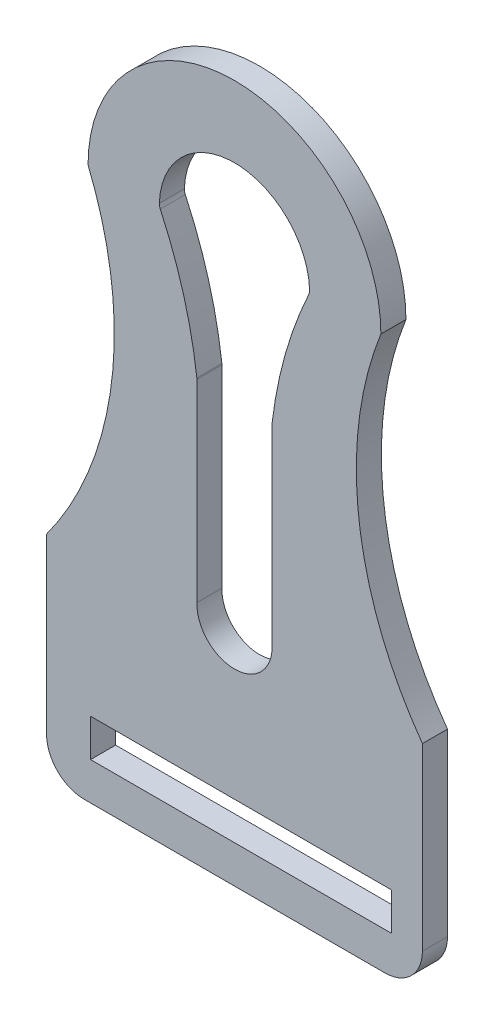
ISO-10303-21;
HEADER;
FILE_DESCRIPTION(('STEP AP214'),'2;1');
FILE_NAME('part.step','',(''),(''),'','','');
FILE_SCHEMA(('AUTOMOTIVE_DESIGN { 1 0 10303 214 1 1 1 1 }'));
ENDSEC;
DATA;
#1=APPLICATION_CONTEXT('core data for automotive mechanical design processes');
#2=APPLICATION_PROTOCOL_DEFINITION('international standard','automotive_design',2000,#1);
#3=PRODUCT_CONTEXT('',#1,'mechanical');
#4=PRODUCT('Part','Part','',(#3));
#5=PRODUCT_RELATED_PRODUCT_CATEGORY('part','',(#4));
#6=PRODUCT_DEFINITION_FORMATION('','',#4);
#7=PRODUCT_DEFINITION_CONTEXT('part definition',#1,'design');
#8=PRODUCT_DEFINITION('design','',#6,#7);
#9=PRODUCT_DEFINITION_SHAPE('','',#8);
#10=(LENGTH_UNIT() NAMED_UNIT(*) SI_UNIT(.MILLI.,.METRE.));
#11=(NAMED_UNIT(*) PLANE_ANGLE_UNIT() SI_UNIT($,.RADIAN.));
#12=(NAMED_UNIT(*) SI_UNIT($,.STERADIAN.) SOLID_ANGLE_UNIT());
#13=UNCERTAINTY_MEASURE_WITH_UNIT(LENGTH_MEASURE(1.E-05),#10,'distance_accuracy_value','');
#14=(GEOMETRIC_REPRESENTATION_CONTEXT(3) GLOBAL_UNCERTAINTY_ASSIGNED_CONTEXT((#13)) GLOBAL_UNIT_ASSIGNED_CONTEXT((#10,
#11,#12)) REPRESENTATION_CONTEXT('',''));
#15=CARTESIAN_POINT('',(0.,0.,0.));
#16=DIRECTION('',(0.,0.,1.));
#17=DIRECTION('',(1.,0.,0.));
#18=AXIS2_PLACEMENT_3D('',#15,#16,#17);
#19=CARTESIAN_POINT('',(-38.1,-105.430018939394,6.35));
#20=DIRECTION('',(0.,0.,1.));
#21=DIRECTION('',(1.,0.,0.));
#22=AXIS2_PLACEMENT_3D('',#19,#20,#21);
#23=PLANE('',#22);
#24=CARTESIAN_POINT('',(-116.692382649276,-21.2894366132639,6.35));
#25=DIRECTION('',(0.,0.,-1.));
#26=DIRECTION('',(1.,0.,0.));
#27=AXIS2_PLACEMENT_3D('',#24,#25,#26);
#28=CIRCLE('',#27,107.95);
#29=CARTESIAN_POINT('',(-18.8042247786519,24.2200244766647,6.35));
#30=VERTEX_POINT('',#29);
#31=CARTESIAN_POINT('',(-9.53884624865419,-8.20042836815369,6.35));
#32=VERTEX_POINT('',#31);
#33=EDGE_CURVE('E242',#30,#32,#28,.T.);
#34=ORIENTED_EDGE('',*,*,#33,.F.);
#35=CARTESIAN_POINT('',(-16.5009740052255,25.2908353258395,6.35));
#36=DIRECTION('',(0.,0.,1.));
#37=DIRECTION('',(1.,0.,0.));
#38=AXIS2_PLACEMENT_3D('',#35,#36,#37);
#39=CIRCLE('',#38,2.54);
#40=CARTESIAN_POINT('',(-19.0395853906448,25.3748129051062,6.35));
#41=VERTEX_POINT('',#40);
#42=EDGE_CURVE('E240',#41,#30,#39,.T.);
#43=ORIENTED_EDGE('',*,*,#42,.F.);
#44=CARTESIAN_POINT('',(0.,24.7449810606061,6.35));
#45=DIRECTION('',(0.,0.,1.));
#46=DIRECTION('',(1.,0.,0.));
#47=AXIS2_PLACEMENT_3D('',#44,#45,#46);
#48=CIRCLE('',#47,19.05);
#49=CARTESIAN_POINT('',(19.039643908874,25.3730414265562,6.35));
#50=VERTEX_POINT('',#49);
#51=EDGE_CURVE('E259',#50,#41,#48,.T.);
#52=ORIENTED_EDGE('',*,*,#51,.F.);
#53=CARTESIAN_POINT('',(16.5010247210241,25.2893000444296,6.35));
#54=DIRECTION('',(0.,0.,1.));
#55=DIRECTION('',(-1.,0.,0.));
#56=AXIS2_PLACEMENT_3D('',#53,#54,#55);
#57=CIRCLE('',#56,2.54);
#58=CARTESIAN_POINT('',(18.8055386735332,24.2212104214619,6.35));
#59=VERTEX_POINT('',#58);
#60=EDGE_CURVE('E256',#59,#50,#57,.T.);
#61=ORIENTED_EDGE('',*,*,#60,.F.);
#62=CARTESIAN_POINT('',(116.747381655168,-21.1725985546614,6.35));
#63=DIRECTION('',(0.,0.,-1.));
#64=DIRECTION('',(1.,0.,0.));
#65=AXIS2_PLACEMENT_3D('',#62,#63,#64);
#66=CIRCLE('',#65,107.95);
#67=CARTESIAN_POINT('',(9.54253297216465,-8.51072985946741,6.35));
#68=VERTEX_POINT('',#67);
#69=EDGE_CURVE('E254',#68,#59,#66,.T.);
#70=ORIENTED_EDGE('',*,*,#69,.F.);
#71=CARTESIAN_POINT('',(12.065,-8.80865618170727,6.35));
#72=DIRECTION('',(0.,0.,-1.));
#73=DIRECTION('',(1.,0.,0.));
#74=AXIS2_PLACEMENT_3D('',#71,#72,#73);
#75=CIRCLE('',#74,2.54);
#76=CARTESIAN_POINT('',(9.52500000000002,-8.80865618170727,6.35));
#77=VERTEX_POINT('',#76);
#78=EDGE_CURVE('E252',#77,#68,#75,.T.);
#79=ORIENTED_EDGE('',*,*,#78,.F.);
#80=DIRECTION('',(0.,1.,0.));
#81=VECTOR('',#80,1.);
#82=CARTESIAN_POINT('',(9.52500000000002,-8.80865618170727,6.35));
#83=LINE('',#82,#81);
#84=CARTESIAN_POINT('',(9.52500000000002,-57.8050189393939,6.35));
#85=VERTEX_POINT('',#84);
#86=EDGE_CURVE('E250',#85,#77,#83,.T.);
#87=ORIENTED_EDGE('',*,*,#86,.F.);
#88=CARTESIAN_POINT('',(0.,-57.8050189393939,6.35));
#89=DIRECTION('',(0.,0.,1.));
#90=DIRECTION('',(-1.,0.,0.));
#91=AXIS2_PLACEMENT_3D('',#88,#89,#90);
#92=CIRCLE('',#91,9.525);
#93=CARTESIAN_POINT('',(-9.52010592866882,-57.4997189116761,6.35));
#94=VERTEX_POINT('',#93);
#95=EDGE_CURVE('E248',#94,#85,#92,.T.);
#96=ORIENTED_EDGE('',*,*,#95,.F.);
#97=DIRECTION('',(0.,-1.,0.));
#98=VECTOR('',#97,1.);
#99=CARTESIAN_POINT('',(-9.52010592866882,-57.4997189116761,6.35));
#100=LINE('',#99,#98);
#101=CARTESIAN_POINT('',(-9.52010592866882,-8.50840503274452,6.35));
#102=VERTEX_POINT('',#101);
#103=EDGE_CURVE('E246',#102,#94,#100,.T.);
#104=ORIENTED_EDGE('',*,*,#103,.F.);
#105=CARTESIAN_POINT('',(-12.0601059286688,-8.50840503274452,6.35));
#106=DIRECTION('',(0.,0.,-1.));
#107=DIRECTION('',(1.,0.,0.));
#108=AXIS2_PLACEMENT_3D('',#105,#106,#107);
#109=CIRCLE('',#108,2.53999999999999);
#110=EDGE_CURVE('E244',#32,#102,#109,.T.);
#111=ORIENTED_EDGE('',*,*,#110,.F.);
#112=EDGE_LOOP('',(#34,#43,#52,#61,#70,#79,#87,#96,#104,#111));
#113=FACE_BOUND('',#112,.T.);
#114=CARTESIAN_POINT('',(-38.1,-105.430018939394,6.35));
#115=DIRECTION('',(0.,0.,1.));
#116=DIRECTION('',(1.,0.,0.));
#117=AXIS2_PLACEMENT_3D('',#114,#115,#116);
#118=CIRCLE('',#117,9.525);
#119=CARTESIAN_POINT('',(-47.625,-105.430018939394,6.35));
#120=VERTEX_POINT('',#119);
#121=CARTESIAN_POINT('',(-38.1,-114.955018939394,6.35));
#122=VERTEX_POINT('',#121);
#123=EDGE_CURVE('E300',#120,#122,#118,.T.);
#124=ORIENTED_EDGE('',*,*,#123,.T.);
#125=DIRECTION('',(1.,0.,0.));
#126=VECTOR('',#125,1.);
#127=CARTESIAN_POINT('',(-38.1,-114.955018939394,6.35));
#128=LINE('',#127,#126);
#129=CARTESIAN_POINT('',(38.1,-114.955018939394,6.35));
#130=VERTEX_POINT('',#129);
#131=EDGE_CURVE('E303',#122,#130,#128,.T.);
#132=ORIENTED_EDGE('',*,*,#131,.T.);
#133=CARTESIAN_POINT('',(38.1,-105.430018939394,6.35));
#134=DIRECTION('',(0.,0.,1.));
#135=DIRECTION('',(1.,0.,0.));
#136=AXIS2_PLACEMENT_3D('',#133,#134,#135);
#137=CIRCLE('',#136,9.525);
#138=CARTESIAN_POINT('',(47.625,-105.430018939394,6.35));
#139=VERTEX_POINT('',#138);
#140=EDGE_CURVE('E305',#130,#139,#137,.T.);
#141=ORIENTED_EDGE('',*,*,#140,.T.);
#142=DIRECTION('',(0.,1.,0.));
#143=VECTOR('',#142,1.);
#144=CARTESIAN_POINT('',(47.625,-59.8746596876549,6.35));
#145=LINE('',#144,#143);
#146=CARTESIAN_POINT('',(47.625,-59.8746596876548,6.35));
#147=VERTEX_POINT('',#146);
#148=EDGE_CURVE('E307',#139,#147,#145,.T.);
#149=ORIENTED_EDGE('',*,*,#148,.T.);
#150=CARTESIAN_POINT('',(119.777059158928,-7.93921553699248,6.35));
#151=DIRECTION('',(0.,0.,-1.));
#152=DIRECTION('',(1.,0.,0.));
#153=AXIS2_PLACEMENT_3D('',#150,#151,#152);
#154=CIRCLE('',#153,88.9);
#155=CARTESIAN_POINT('',(37.1032828282829,24.7449810606061,6.35));
#156=VERTEX_POINT('',#155);
#157=EDGE_CURVE('E309',#147,#156,#154,.T.);
#158=ORIENTED_EDGE('',*,*,#157,.T.);
#159=CARTESIAN_POINT('',(0.,24.7449810606061,6.35));
#160=DIRECTION('',(0.,0.,1.));
#161=DIRECTION('',(-1.,0.,0.));
#162=AXIS2_PLACEMENT_3D('',#159,#160,#161);
#163=CIRCLE('',#162,37.1032828282829);
#164=CARTESIAN_POINT('',(-37.1032828282828,24.7449810606061,6.35));
#165=VERTEX_POINT('',#164);
#166=EDGE_CURVE('E311',#156,#165,#163,.T.);
#167=ORIENTED_EDGE('',*,*,#166,.T.);
#168=CARTESIAN_POINT('',(-119.349843752761,-8.99984396629402,6.35));
#169=DIRECTION('',(0.,0.,-1.));
#170=DIRECTION('',(-1.,0.,0.));
#171=AXIS2_PLACEMENT_3D('',#168,#169,#170);
#172=CIRCLE('',#171,88.9);
#173=CARTESIAN_POINT('',(-47.625,-61.523712717958,6.35));
#174=VERTEX_POINT('',#173);
#175=EDGE_CURVE('E313',#165,#174,#172,.T.);
#176=ORIENTED_EDGE('',*,*,#175,.T.);
#177=DIRECTION('',(0.,-1.,0.));
#178=VECTOR('',#177,1.);
#179=CARTESIAN_POINT('',(-47.625,-61.523712717958,6.35));
#180=LINE('',#179,#178);
#181=EDGE_CURVE('E315',#174,#120,#180,.T.);
#182=ORIENTED_EDGE('',*,*,#181,.T.);
#183=EDGE_LOOP('',(#124,#132,#141,#149,#158,#167,#176,#182));
#184=FACE_BOUND('',#183,.T.);
#185=DIRECTION('',(1.,0.,0.));
#186=VECTOR('',#185,1.);
#187=CARTESIAN_POINT('',(-36.4662878787879,-105.430018939394,6.35));
#188=LINE('',#187,#186);
#189=CARTESIAN_POINT('',(-36.4662878787879,-105.430018939394,6.35));
#190=VERTEX_POINT('',#189);
#191=CARTESIAN_POINT('',(39.7337121212121,-105.430018939394,6.35));
#192=VERTEX_POINT('',#191);
#193=EDGE_CURVE('E201',#190,#192,#188,.T.);
#194=ORIENTED_EDGE('',*,*,#193,.F.);
#195=DIRECTION('',(0.,-1.,0.));
#196=VECTOR('',#195,1.);
#197=CARTESIAN_POINT('',(-36.4662878787879,-95.9050189393939,6.35));
#198=LINE('',#197,#196);
#199=CARTESIAN_POINT('',(-36.4662878787879,-95.9050189393939,6.35));
#200=VERTEX_POINT('',#199);
#201=EDGE_CURVE('E190',#200,#190,#198,.T.);
#202=ORIENTED_EDGE('',*,*,#201,.F.);
#203=DIRECTION('',(-1.,0.,0.));
#204=VECTOR('',#203,1.);
#205=CARTESIAN_POINT('',(39.7337121212121,-95.9050189393939,6.35));
#206=LINE('',#205,#204);
#207=CARTESIAN_POINT('',(39.7337121212121,-95.9050189393939,6.35));
#208=VERTEX_POINT('',#207);
#209=EDGE_CURVE('E205',#208,#200,#206,.T.);
#210=ORIENTED_EDGE('',*,*,#209,.F.);
#211=DIRECTION('',(0.,1.,0.));
#212=VECTOR('',#211,1.);
#213=CARTESIAN_POINT('',(39.7337121212121,-105.430018939394,6.35));
#214=LINE('',#213,#212);
#215=EDGE_CURVE('E203',#192,#208,#214,.T.);
#216=ORIENTED_EDGE('',*,*,#215,.F.);
#217=EDGE_LOOP('',(#194,#202,#210,#216));
#218=FACE_BOUND('',#217,.T.);
#219=ADVANCED_FACE('F26',(#113,#184,#218),#23,.T.);
#220=CARTESIAN_POINT('',(-38.1,-105.430018939394,0.));
#221=DIRECTION('',(0.,0.,1.));
#222=DIRECTION('',(1.,0.,0.));
#223=AXIS2_PLACEMENT_3D('',#220,#221,#222);
#224=PLANE('',#223);
#225=CARTESIAN_POINT('',(-16.5009740052255,25.2908353258395,0.));
#226=DIRECTION('',(0.,0.,1.));
#227=DIRECTION('',(1.,0.,0.));
#228=AXIS2_PLACEMENT_3D('',#225,#226,#227);
#229=CIRCLE('',#228,2.54);
#230=CARTESIAN_POINT('',(-19.0395853906448,25.3748129051062,0.));
#231=VERTEX_POINT('',#230);
#232=CARTESIAN_POINT('',(-18.8042247786519,24.2200244766647,0.));
#233=VERTEX_POINT('',#232);
#234=EDGE_CURVE('E191',#231,#233,#229,.T.);
#235=ORIENTED_EDGE('',*,*,#234,.T.);
#236=CARTESIAN_POINT('',(-116.692382649276,-21.2894366132639,0.));
#237=DIRECTION('',(0.,0.,-1.));
#238=DIRECTION('',(1.,0.,0.));
#239=AXIS2_PLACEMENT_3D('',#236,#237,#238);
#240=CIRCLE('',#239,107.95);
#241=CARTESIAN_POINT('',(-9.53884624865419,-8.20042836815369,0.));
#242=VERTEX_POINT('',#241);
#243=EDGE_CURVE('E213',#233,#242,#240,.T.);
#244=ORIENTED_EDGE('',*,*,#243,.T.);
#245=CARTESIAN_POINT('',(-12.0601059286688,-8.50840503274452,0.));
#246=DIRECTION('',(0.,0.,-1.));
#247=DIRECTION('',(1.,0.,0.));
#248=AXIS2_PLACEMENT_3D('',#245,#246,#247);
#249=CIRCLE('',#248,2.53999999999999);
#250=CARTESIAN_POINT('',(-9.52010592866882,-8.50840503274452,0.));
#251=VERTEX_POINT('',#250);
#252=EDGE_CURVE('E216',#242,#251,#249,.T.);
#253=ORIENTED_EDGE('',*,*,#252,.T.);
#254=DIRECTION('',(0.,-1.,0.));
#255=VECTOR('',#254,1.);
#256=CARTESIAN_POINT('',(-9.52010592866882,-57.4997189116761,0.));
#257=LINE('',#256,#255);
#258=CARTESIAN_POINT('',(-9.52010592866882,-57.4997189116761,0.));
#259=VERTEX_POINT('',#258);
#260=EDGE_CURVE('E219',#251,#259,#257,.T.);
#261=ORIENTED_EDGE('',*,*,#260,.T.);
#262=CARTESIAN_POINT('',(0.,-57.8050189393939,0.));
#263=DIRECTION('',(0.,0.,1.));
#264=DIRECTION('',(-1.,0.,0.));
#265=AXIS2_PLACEMENT_3D('',#262,#263,#264);
#266=CIRCLE('',#265,9.525);
#267=CARTESIAN_POINT('',(9.52500000000002,-57.8050189393939,0.));
#268=VERTEX_POINT('',#267);
#269=EDGE_CURVE('E222',#259,#268,#266,.T.);
#270=ORIENTED_EDGE('',*,*,#269,.T.);
#271=DIRECTION('',(0.,1.,0.));
#272=VECTOR('',#271,1.);
#273=CARTESIAN_POINT('',(9.52500000000002,-8.80865618170727,0.));
#274=LINE('',#273,#272);
#275=CARTESIAN_POINT('',(9.52500000000002,-8.80865618170727,0.));
#276=VERTEX_POINT('',#275);
#277=EDGE_CURVE('E225',#268,#276,#274,.T.);
#278=ORIENTED_EDGE('',*,*,#277,.T.);
#279=CARTESIAN_POINT('',(12.065,-8.80865618170727,0.));
#280=DIRECTION('',(0.,0.,-1.));
#281=DIRECTION('',(1.,0.,0.));
#282=AXIS2_PLACEMENT_3D('',#279,#280,#281);
#283=CIRCLE('',#282,2.54);
#284=CARTESIAN_POINT('',(9.54253297216465,-8.51072985946741,0.));
#285=VERTEX_POINT('',#284);
#286=EDGE_CURVE('E228',#276,#285,#283,.T.);
#287=ORIENTED_EDGE('',*,*,#286,.T.);
#288=CARTESIAN_POINT('',(116.747381655168,-21.1725985546614,0.));
#289=DIRECTION('',(0.,0.,-1.));
#290=DIRECTION('',(1.,0.,0.));
#291=AXIS2_PLACEMENT_3D('',#288,#289,#290);
#292=CIRCLE('',#291,107.95);
#293=CARTESIAN_POINT('',(18.8055386735332,24.2212104214619,0.));
#294=VERTEX_POINT('',#293);
#295=EDGE_CURVE('E231',#285,#294,#292,.T.);
#296=ORIENTED_EDGE('',*,*,#295,.T.);
#297=CARTESIAN_POINT('',(16.5010247210241,25.2893000444296,0.));
#298=DIRECTION('',(0.,0.,1.));
#299=DIRECTION('',(-1.,0.,0.));
#300=AXIS2_PLACEMENT_3D('',#297,#298,#299);
#301=CIRCLE('',#300,2.54);
#302=CARTESIAN_POINT('',(19.039643908874,25.3730414265562,0.));
#303=VERTEX_POINT('',#302);
#304=EDGE_CURVE('E234',#294,#303,#301,.T.);
#305=ORIENTED_EDGE('',*,*,#304,.T.);
#306=CARTESIAN_POINT('',(0.,24.7449810606061,0.));
#307=DIRECTION('',(0.,0.,1.));
#308=DIRECTION('',(1.,0.,0.));
#309=AXIS2_PLACEMENT_3D('',#306,#307,#308);
#310=CIRCLE('',#309,19.05);
#311=EDGE_CURVE('E237',#303,#231,#310,.T.);
#312=ORIENTED_EDGE('',*,*,#311,.T.);
#313=EDGE_LOOP('',(#235,#244,#253,#261,#270,#278,#287,#296,#305,#312));
#314=FACE_BOUND('',#313,.T.);
#315=CARTESIAN_POINT('',(-38.1,-105.430018939394,0.));
#316=DIRECTION('',(0.,0.,1.));
#317=DIRECTION('',(1.,0.,0.));
#318=AXIS2_PLACEMENT_3D('',#315,#316,#317);
#319=CIRCLE('',#318,9.525);
#320=CARTESIAN_POINT('',(-47.625,-105.430018939394,0.));
#321=VERTEX_POINT('',#320);
#322=CARTESIAN_POINT('',(-38.1,-114.955018939394,0.));
#323=VERTEX_POINT('',#322);
#324=EDGE_CURVE('E283',#321,#323,#319,.T.);
#325=ORIENTED_EDGE('',*,*,#324,.F.);
#326=DIRECTION('',(0.,-1.,0.));
#327=VECTOR('',#326,1.);
#328=CARTESIAN_POINT('',(-47.625,-61.523712717958,0.));
#329=LINE('',#328,#327);
#330=CARTESIAN_POINT('',(-47.625,-61.523712717958,0.));
#331=VERTEX_POINT('',#330);
#332=EDGE_CURVE('E298',#331,#321,#329,.T.);
#333=ORIENTED_EDGE('',*,*,#332,.F.);
#334=CARTESIAN_POINT('',(-119.349843752761,-8.99984396629402,0.));
#335=DIRECTION('',(0.,0.,-1.));
#336=DIRECTION('',(-1.,0.,0.));
#337=AXIS2_PLACEMENT_3D('',#334,#335,#336);
#338=CIRCLE('',#337,88.9);
#339=CARTESIAN_POINT('',(-37.1032828282828,24.7449810606061,0.));
#340=VERTEX_POINT('',#339);
#341=EDGE_CURVE('E296',#340,#331,#338,.T.);
#342=ORIENTED_EDGE('',*,*,#341,.F.);
#343=CARTESIAN_POINT('',(0.,24.7449810606061,0.));
#344=DIRECTION('',(0.,0.,1.));
#345=DIRECTION('',(-1.,0.,0.));
#346=AXIS2_PLACEMENT_3D('',#343,#344,#345);
#347=CIRCLE('',#346,37.1032828282829);
#348=CARTESIAN_POINT('',(37.1032828282829,24.7449810606061,0.));
#349=VERTEX_POINT('',#348);
#350=EDGE_CURVE('E294',#349,#340,#347,.T.);
#351=ORIENTED_EDGE('',*,*,#350,.F.);
#352=CARTESIAN_POINT('',(119.777059158928,-7.93921553699248,0.));
#353=DIRECTION('',(0.,0.,-1.));
#354=DIRECTION('',(1.,0.,0.));
#355=AXIS2_PLACEMENT_3D('',#352,#353,#354);
#356=CIRCLE('',#355,88.9);
#357=CARTESIAN_POINT('',(47.625,-59.8746596876548,0.));
#358=VERTEX_POINT('',#357);
#359=EDGE_CURVE('E292',#358,#349,#356,.T.);
#360=ORIENTED_EDGE('',*,*,#359,.F.);
#361=DIRECTION('',(0.,1.,0.));
#362=VECTOR('',#361,1.);
#363=CARTESIAN_POINT('',(47.625,-59.8746596876549,0.));
#364=LINE('',#363,#362);
#365=CARTESIAN_POINT('',(47.625,-105.430018939394,0.));
#366=VERTEX_POINT('',#365);
#367=EDGE_CURVE('E290',#366,#358,#364,.T.);
#368=ORIENTED_EDGE('',*,*,#367,.F.);
#369=CARTESIAN_POINT('',(38.1,-105.430018939394,0.));
#370=DIRECTION('',(0.,0.,1.));
#371=DIRECTION('',(1.,0.,0.));
#372=AXIS2_PLACEMENT_3D('',#369,#370,#371);
#373=CIRCLE('',#372,9.525);
#374=CARTESIAN_POINT('',(38.1,-114.955018939394,0.));
#375=VERTEX_POINT('',#374);
#376=EDGE_CURVE('E288',#375,#366,#373,.T.);
#377=ORIENTED_EDGE('',*,*,#376,.F.);
#378=DIRECTION('',(1.,0.,0.));
#379=VECTOR('',#378,1.);
#380=CARTESIAN_POINT('',(-38.1,-114.955018939394,0.));
#381=LINE('',#380,#379);
#382=EDGE_CURVE('E286',#323,#375,#381,.T.);
#383=ORIENTED_EDGE('',*,*,#382,.F.);
#384=EDGE_LOOP('',(#325,#333,#342,#351,#360,#368,#377,#383));
#385=FACE_BOUND('',#384,.T.);
#386=DIRECTION('',(0.,-1.,0.));
#387=VECTOR('',#386,1.);
#388=CARTESIAN_POINT('',(-36.4662878787879,-95.9050189393939,0.));
#389=LINE('',#388,#387);
#390=CARTESIAN_POINT('',(-36.4662878787879,-95.9050189393939,0.));
#391=VERTEX_POINT('',#390);
#392=CARTESIAN_POINT('',(-36.4662878787879,-105.430018939394,0.));
#393=VERTEX_POINT('',#392);
#394=EDGE_CURVE('E49',#391,#393,#389,.T.);
#395=ORIENTED_EDGE('',*,*,#394,.T.);
#396=DIRECTION('',(1.,0.,0.));
#397=VECTOR('',#396,1.);
#398=CARTESIAN_POINT('',(-36.4662878787879,-105.430018939394,0.));
#399=LINE('',#398,#397);
#400=CARTESIAN_POINT('',(39.7337121212121,-105.430018939394,0.));
#401=VERTEX_POINT('',#400);
#402=EDGE_CURVE('E177',#393,#401,#399,.T.);
#403=ORIENTED_EDGE('',*,*,#402,.T.);
#404=DIRECTION('',(0.,1.,0.));
#405=VECTOR('',#404,1.);
#406=CARTESIAN_POINT('',(39.7337121212121,-105.430018939394,0.));
#407=LINE('',#406,#405);
#408=CARTESIAN_POINT('',(39.7337121212121,-95.9050189393939,0.));
#409=VERTEX_POINT('',#408);
#410=EDGE_CURVE('E186',#401,#409,#407,.T.);
#411=ORIENTED_EDGE('',*,*,#410,.T.);
#412=DIRECTION('',(-1.,0.,0.));
#413=VECTOR('',#412,1.);
#414=CARTESIAN_POINT('',(39.7337121212121,-95.9050189393939,0.));
#415=LINE('',#414,#413);
#416=EDGE_CURVE('E195',#409,#391,#415,.T.);
#417=ORIENTED_EDGE('',*,*,#416,.T.);
#418=EDGE_LOOP('',(#395,#403,#411,#417));
#419=FACE_BOUND('',#418,.T.);
#420=ADVANCED_FACE('F194',(#314,#385,#419),#224,.F.);
#421=CARTESIAN_POINT('',(-38.1,-105.430018939394,6.35));
#422=DIRECTION('',(0.,0.,-1.));
#423=DIRECTION('',(-1.,0.,0.));
#424=AXIS2_PLACEMENT_3D('',#421,#422,#423);
#425=CYLINDRICAL_SURFACE('',#424,9.525);
#426=ORIENTED_EDGE('',*,*,#324,.T.);
#427=DIRECTION('',(0.,0.,-1.));
#428=VECTOR('',#427,1.);
#429=CARTESIAN_POINT('',(-38.1,-114.955018939394,6.35));
#430=LINE('',#429,#428);
#431=EDGE_CURVE('E11',#122,#323,#430,.T.);
#432=ORIENTED_EDGE('',*,*,#431,.F.);
#433=ORIENTED_EDGE('',*,*,#123,.F.);
#434=DIRECTION('',(0.,0.,-1.));
#435=VECTOR('',#434,1.);
#436=CARTESIAN_POINT('',(-47.625,-105.430018939394,6.35));
#437=LINE('',#436,#435);
#438=EDGE_CURVE('E317',#120,#321,#437,.T.);
#439=ORIENTED_EDGE('',*,*,#438,.T.);
#440=EDGE_LOOP('',(#426,#432,#433,#439));
#441=FACE_BOUND('',#440,.T.);
#442=ADVANCED_FACE('F28',(#441),#425,.T.);
#443=CARTESIAN_POINT('',(-38.1,-114.955018939394,6.35));
#444=DIRECTION('',(0.,1.,0.));
#445=DIRECTION('',(-1.,0.,0.));
#446=AXIS2_PLACEMENT_3D('',#443,#444,#445);
#447=PLANE('',#446);
#448=ORIENTED_EDGE('',*,*,#382,.T.);
#449=DIRECTION('',(0.,0.,-1.));
#450=VECTOR('',#449,1.);
#451=CARTESIAN_POINT('',(38.1,-114.955018939394,6.35));
#452=LINE('',#451,#450);
#453=EDGE_CURVE('E34',#130,#375,#452,.T.);
#454=ORIENTED_EDGE('',*,*,#453,.F.);
#455=ORIENTED_EDGE('',*,*,#131,.F.);
#456=ORIENTED_EDGE('',*,*,#431,.T.);
#457=EDGE_LOOP('',(#448,#454,#455,#456));
#458=FACE_BOUND('',#457,.T.);
#459=ADVANCED_FACE('F361',(#458),#447,.F.);
#460=CARTESIAN_POINT('',(38.1,-105.430018939394,6.35));
#461=DIRECTION('',(0.,0.,-1.));
#462=DIRECTION('',(-1.,0.,0.));
#463=AXIS2_PLACEMENT_3D('',#460,#461,#462);
#464=CYLINDRICAL_SURFACE('',#463,9.525);
#465=ORIENTED_EDGE('',*,*,#376,.T.);
#466=DIRECTION('',(0.,0.,-1.));
#467=VECTOR('',#466,1.);
#468=CARTESIAN_POINT('',(47.625,-105.430018939394,6.35));
#469=LINE('',#468,#467);
#470=EDGE_CURVE('E332',#139,#366,#469,.T.);
#471=ORIENTED_EDGE('',*,*,#470,.F.);
#472=ORIENTED_EDGE('',*,*,#140,.F.);
#473=ORIENTED_EDGE('',*,*,#453,.T.);
#474=EDGE_LOOP('',(#465,#471,#472,#473));
#475=FACE_BOUND('',#474,.T.);
#476=ADVANCED_FACE('F339',(#475),#464,.T.);
#477=CARTESIAN_POINT('',(47.625,-59.8746596876549,6.35));
#478=DIRECTION('',(-1.,0.,0.));
#479=DIRECTION('',(0.,-1.,0.));
#480=AXIS2_PLACEMENT_3D('',#477,#478,#479);
#481=PLANE('',#480);
#482=ORIENTED_EDGE('',*,*,#367,.T.);
#483=DIRECTION('',(0.,0.,-1.));
#484=VECTOR('',#483,1.);
#485=CARTESIAN_POINT('',(47.625,-59.8746596876548,6.35));
#486=LINE('',#485,#484);
#487=EDGE_CURVE('E329',#147,#358,#486,.T.);
#488=ORIENTED_EDGE('',*,*,#487,.F.);
#489=ORIENTED_EDGE('',*,*,#148,.F.);
#490=ORIENTED_EDGE('',*,*,#470,.T.);
#491=EDGE_LOOP('',(#482,#488,#489,#490));
#492=FACE_BOUND('',#491,.T.);
#493=ADVANCED_FACE('F349',(#492),#481,.F.);
#494=CARTESIAN_POINT('',(119.777059158928,-7.93921553699248,6.35));
#495=DIRECTION('',(0.,0.,-1.));
#496=DIRECTION('',(-1.,0.,0.));
#497=AXIS2_PLACEMENT_3D('',#494,#495,#496);
#498=CYLINDRICAL_SURFACE('',#497,88.9);
#499=ORIENTED_EDGE('',*,*,#359,.T.);
#500=DIRECTION('',(0.,0.,-1.));
#501=VECTOR('',#500,1.);
#502=CARTESIAN_POINT('',(37.1032828282829,24.7449810606061,6.35));
#503=LINE('',#502,#501);
#504=EDGE_CURVE('E326',#156,#349,#503,.T.);
#505=ORIENTED_EDGE('',*,*,#504,.F.);
#506=ORIENTED_EDGE('',*,*,#157,.F.);
#507=ORIENTED_EDGE('',*,*,#487,.T.);
#508=EDGE_LOOP('',(#499,#505,#506,#507));
#509=FACE_BOUND('',#508,.T.);
#510=ADVANCED_FACE('F353',(#509),#498,.F.);
#511=CARTESIAN_POINT('',(0.,24.7449810606061,6.35));
#512=DIRECTION('',(0.,0.,-1.));
#513=DIRECTION('',(-1.,0.,0.));
#514=AXIS2_PLACEMENT_3D('',#511,#512,#513);
#515=CYLINDRICAL_SURFACE('',#514,37.1032828282829);
#516=ORIENTED_EDGE('',*,*,#350,.T.);
#517=DIRECTION('',(0.,0.,-1.));
#518=VECTOR('',#517,1.);
#519=CARTESIAN_POINT('',(-37.1032828282828,24.7449810606061,6.35));
#520=LINE('',#519,#518);
#521=EDGE_CURVE('E323',#165,#340,#520,.T.);
#522=ORIENTED_EDGE('',*,*,#521,.F.);
#523=ORIENTED_EDGE('',*,*,#166,.F.);
#524=ORIENTED_EDGE('',*,*,#504,.T.);
#525=EDGE_LOOP('',(#516,#522,#523,#524));
#526=FACE_BOUND('',#525,.T.);
#527=ADVANCED_FACE('F374',(#526),#515,.T.);
#528=CARTESIAN_POINT('',(-119.349843752761,-8.99984396629402,6.35));
#529=DIRECTION('',(0.,0.,-1.));
#530=DIRECTION('',(-1.,0.,0.));
#531=AXIS2_PLACEMENT_3D('',#528,#529,#530);
#532=CYLINDRICAL_SURFACE('',#531,88.9);
#533=ORIENTED_EDGE('',*,*,#341,.T.);
#534=DIRECTION('',(0.,0.,-1.));
#535=VECTOR('',#534,1.);
#536=CARTESIAN_POINT('',(-47.625,-61.523712717958,6.35));
#537=LINE('',#536,#535);
#538=EDGE_CURVE('E320',#174,#331,#537,.T.);
#539=ORIENTED_EDGE('',*,*,#538,.F.);
#540=ORIENTED_EDGE('',*,*,#175,.F.);
#541=ORIENTED_EDGE('',*,*,#521,.T.);
#542=EDGE_LOOP('',(#533,#539,#540,#541));
#543=FACE_BOUND('',#542,.T.);
#544=ADVANCED_FACE('F372',(#543),#532,.F.);
#545=CARTESIAN_POINT('',(-47.625,-61.523712717958,6.35));
#546=DIRECTION('',(1.,0.,0.));
#547=DIRECTION('',(0.,1.,0.));
#548=AXIS2_PLACEMENT_3D('',#545,#546,#547);
#549=PLANE('',#548);
#550=ORIENTED_EDGE('',*,*,#332,.T.);
#551=ORIENTED_EDGE('',*,*,#438,.F.);
#552=ORIENTED_EDGE('',*,*,#181,.F.);
#553=ORIENTED_EDGE('',*,*,#538,.T.);
#554=EDGE_LOOP('',(#550,#551,#552,#553));
#555=FACE_BOUND('',#554,.T.);
#556=ADVANCED_FACE('F367',(#555),#549,.F.);
#557=CARTESIAN_POINT('',(-16.5009740052255,25.2908353258395,6.35));
#558=DIRECTION('',(0.,0.,-1.));
#559=DIRECTION('',(-1.,0.,0.));
#560=AXIS2_PLACEMENT_3D('',#557,#558,#559);
#561=CYLINDRICAL_SURFACE('',#560,2.54);
#562=ORIENTED_EDGE('',*,*,#234,.F.);
#563=DIRECTION('',(0.,0.,-1.));
#564=VECTOR('',#563,1.);
#565=CARTESIAN_POINT('',(-19.0395853906448,25.3748129051062,6.35));
#566=LINE('',#565,#564);
#567=EDGE_CURVE('E261',#41,#231,#566,.T.);
#568=ORIENTED_EDGE('',*,*,#567,.F.);
#569=ORIENTED_EDGE('',*,*,#42,.T.);
#570=DIRECTION('',(0.,0.,-1.));
#571=VECTOR('',#570,1.);
#572=CARTESIAN_POINT('',(-18.8042247786519,24.2200244766647,6.35));
#573=LINE('',#572,#571);
#574=EDGE_CURVE('E280',#30,#233,#573,.T.);
#575=ORIENTED_EDGE('',*,*,#574,.T.);
#576=EDGE_LOOP('',(#562,#568,#569,#575));
#577=FACE_BOUND('',#576,.T.);
#578=ADVANCED_FACE('F395',(#577),#561,.F.);
#579=CARTESIAN_POINT('',(-116.692382649276,-21.2894366132639,6.35));
#580=DIRECTION('',(0.,0.,-1.));
#581=DIRECTION('',(-1.,0.,0.));
#582=AXIS2_PLACEMENT_3D('',#579,#580,#581);
#583=CYLINDRICAL_SURFACE('',#582,107.95);
#584=ORIENTED_EDGE('',*,*,#243,.F.);
#585=ORIENTED_EDGE('',*,*,#574,.F.);
#586=ORIENTED_EDGE('',*,*,#33,.T.);
#587=DIRECTION('',(0.,0.,-1.));
#588=VECTOR('',#587,1.);
#589=CARTESIAN_POINT('',(-9.53884624865419,-8.20042836815369,6.35));
#590=LINE('',#589,#588);
#591=EDGE_CURVE('E278',#32,#242,#590,.T.);
#592=ORIENTED_EDGE('',*,*,#591,.T.);
#593=EDGE_LOOP('',(#584,#585,#586,#592));
#594=FACE_BOUND('',#593,.T.);
#595=ADVANCED_FACE('F399',(#594),#583,.T.);
#596=CARTESIAN_POINT('',(-12.0601059286688,-8.50840503274452,6.35));
#597=DIRECTION('',(0.,0.,-1.));
#598=DIRECTION('',(-1.,0.,0.));
#599=AXIS2_PLACEMENT_3D('',#596,#597,#598);
#600=CYLINDRICAL_SURFACE('',#599,2.53999999999999);
#601=ORIENTED_EDGE('',*,*,#252,.F.);
#602=ORIENTED_EDGE('',*,*,#591,.F.);
#603=ORIENTED_EDGE('',*,*,#110,.T.);
#604=DIRECTION('',(0.,0.,-1.));
#605=VECTOR('',#604,1.);
#606=CARTESIAN_POINT('',(-9.52010592866882,-8.50840503274452,6.35));
#607=LINE('',#606,#605);
#608=EDGE_CURVE('E276',#102,#251,#607,.T.);
#609=ORIENTED_EDGE('',*,*,#608,.T.);
#610=EDGE_LOOP('',(#601,#602,#603,#609));
#611=FACE_BOUND('',#610,.T.);
#612=ADVANCED_FACE('F404',(#611),#600,.T.);
#613=CARTESIAN_POINT('',(-9.52010592866882,-57.4997189116761,6.35));
#614=DIRECTION('',(1.,0.,0.));
#615=DIRECTION('',(0.,0.,-1.));
#616=AXIS2_PLACEMENT_3D('',#613,#614,#615);
#617=PLANE('',#616);
#618=ORIENTED_EDGE('',*,*,#260,.F.);
#619=ORIENTED_EDGE('',*,*,#608,.F.);
#620=ORIENTED_EDGE('',*,*,#103,.T.);
#621=DIRECTION('',(0.,0.,-1.));
#622=VECTOR('',#621,1.);
#623=CARTESIAN_POINT('',(-9.52010592866882,-57.4997189116761,6.35));
#624=LINE('',#623,#622);
#625=EDGE_CURVE('E274',#94,#259,#624,.T.);
#626=ORIENTED_EDGE('',*,*,#625,.T.);
#627=EDGE_LOOP('',(#618,#619,#620,#626));
#628=FACE_BOUND('',#627,.T.);
#629=ADVANCED_FACE('F410',(#628),#617,.T.);
#630=CARTESIAN_POINT('',(0.,-57.8050189393939,6.35));
#631=DIRECTION('',(0.,0.,-1.));
#632=DIRECTION('',(-1.,0.,0.));
#633=AXIS2_PLACEMENT_3D('',#630,#631,#632);
#634=CYLINDRICAL_SURFACE('',#633,9.525);
#635=ORIENTED_EDGE('',*,*,#269,.F.);
#636=ORIENTED_EDGE('',*,*,#625,.F.);
#637=ORIENTED_EDGE('',*,*,#95,.T.);
#638=DIRECTION('',(0.,0.,-1.));
#639=VECTOR('',#638,1.);
#640=CARTESIAN_POINT('',(9.52500000000002,-57.8050189393939,6.35));
#641=LINE('',#640,#639);
#642=EDGE_CURVE('E272',#85,#268,#641,.T.);
#643=ORIENTED_EDGE('',*,*,#642,.T.);
#644=EDGE_LOOP('',(#635,#636,#637,#643));
#645=FACE_BOUND('',#644,.T.);
#646=ADVANCED_FACE('F414',(#645),#634,.F.);
#647=CARTESIAN_POINT('',(9.52500000000002,-8.80865618170727,6.35));
#648=DIRECTION('',(-1.,0.,0.));
#649=DIRECTION('',(0.,0.,1.));
#650=AXIS2_PLACEMENT_3D('',#647,#648,#649);
#651=PLANE('',#650);
#652=ORIENTED_EDGE('',*,*,#277,.F.);
#653=ORIENTED_EDGE('',*,*,#642,.F.);
#654=ORIENTED_EDGE('',*,*,#86,.T.);
#655=DIRECTION('',(0.,0.,-1.));
#656=VECTOR('',#655,1.);
#657=CARTESIAN_POINT('',(9.52500000000002,-8.80865618170727,6.35));
#658=LINE('',#657,#656);
#659=EDGE_CURVE('E270',#77,#276,#658,.T.);
#660=ORIENTED_EDGE('',*,*,#659,.T.);
#661=EDGE_LOOP('',(#652,#653,#654,#660));
#662=FACE_BOUND('',#661,.T.);
#663=ADVANCED_FACE('F418',(#662),#651,.T.);
#664=CARTESIAN_POINT('',(12.065,-8.80865618170727,6.35));
#665=DIRECTION('',(0.,0.,-1.));
#666=DIRECTION('',(-1.,0.,0.));
#667=AXIS2_PLACEMENT_3D('',#664,#665,#666);
#668=CYLINDRICAL_SURFACE('',#667,2.54);
#669=ORIENTED_EDGE('',*,*,#286,.F.);
#670=ORIENTED_EDGE('',*,*,#659,.F.);
#671=ORIENTED_EDGE('',*,*,#78,.T.);
#672=DIRECTION('',(0.,0.,-1.));
#673=VECTOR('',#672,1.);
#674=CARTESIAN_POINT('',(9.54253297216465,-8.51072985946741,6.35));
#675=LINE('',#674,#673);
#676=EDGE_CURVE('E268',#68,#285,#675,.T.);
#677=ORIENTED_EDGE('',*,*,#676,.T.);
#678=EDGE_LOOP('',(#669,#670,#671,#677));
#679=FACE_BOUND('',#678,.T.);
#680=ADVANCED_FACE('F422',(#679),#668,.T.);
#681=CARTESIAN_POINT('',(116.747381655168,-21.1725985546614,6.35));
#682=DIRECTION('',(0.,0.,-1.));
#683=DIRECTION('',(-1.,0.,0.));
#684=AXIS2_PLACEMENT_3D('',#681,#682,#683);
#685=CYLINDRICAL_SURFACE('',#684,107.95);
#686=ORIENTED_EDGE('',*,*,#295,.F.);
#687=ORIENTED_EDGE('',*,*,#676,.F.);
#688=ORIENTED_EDGE('',*,*,#69,.T.);
#689=DIRECTION('',(0.,0.,-1.));
#690=VECTOR('',#689,1.);
#691=CARTESIAN_POINT('',(18.8055386735332,24.2212104214619,6.35));
#692=LINE('',#691,#690);
#693=EDGE_CURVE('E266',#59,#294,#692,.T.);
#694=ORIENTED_EDGE('',*,*,#693,.T.);
#695=EDGE_LOOP('',(#686,#687,#688,#694));
#696=FACE_BOUND('',#695,.T.);
#697=ADVANCED_FACE('F426',(#696),#685,.T.);
#698=CARTESIAN_POINT('',(16.5010247210241,25.2893000444296,6.35));
#699=DIRECTION('',(0.,0.,-1.));
#700=DIRECTION('',(-1.,0.,0.));
#701=AXIS2_PLACEMENT_3D('',#698,#699,#700);
#702=CYLINDRICAL_SURFACE('',#701,2.54);
#703=ORIENTED_EDGE('',*,*,#304,.F.);
#704=ORIENTED_EDGE('',*,*,#693,.F.);
#705=ORIENTED_EDGE('',*,*,#60,.T.);
#706=DIRECTION('',(0.,0.,-1.));
#707=VECTOR('',#706,1.);
#708=CARTESIAN_POINT('',(19.039643908874,25.3730414265562,6.35));
#709=LINE('',#708,#707);
#710=EDGE_CURVE('E264',#50,#303,#709,.T.);
#711=ORIENTED_EDGE('',*,*,#710,.T.);
#712=EDGE_LOOP('',(#703,#704,#705,#711));
#713=FACE_BOUND('',#712,.T.);
#714=ADVANCED_FACE('F430',(#713),#702,.F.);
#715=CARTESIAN_POINT('',(0.,24.7449810606061,6.35));
#716=DIRECTION('',(0.,0.,-1.));
#717=DIRECTION('',(-1.,0.,0.));
#718=AXIS2_PLACEMENT_3D('',#715,#716,#717);
#719=CYLINDRICAL_SURFACE('',#718,19.05);
#720=ORIENTED_EDGE('',*,*,#311,.F.);
#721=ORIENTED_EDGE('',*,*,#710,.F.);
#722=ORIENTED_EDGE('',*,*,#51,.T.);
#723=ORIENTED_EDGE('',*,*,#567,.T.);
#724=EDGE_LOOP('',(#720,#721,#722,#723));
#725=FACE_BOUND('',#724,.T.);
#726=ADVANCED_FACE('F434',(#725),#719,.F.);
#727=CARTESIAN_POINT('',(-36.4662878787879,-95.9050189393939,6.35));
#728=DIRECTION('',(1.,0.,0.));
#729=DIRECTION('',(0.,0.,-1.));
#730=AXIS2_PLACEMENT_3D('',#727,#728,#729);
#731=PLANE('',#730);
#732=ORIENTED_EDGE('',*,*,#394,.F.);
#733=DIRECTION('',(0.,0.,-1.));
#734=VECTOR('',#733,1.);
#735=CARTESIAN_POINT('',(-36.4662878787879,-95.9050189393939,6.35));
#736=LINE('',#735,#734);
#737=EDGE_CURVE('E207',#200,#391,#736,.T.);
#738=ORIENTED_EDGE('',*,*,#737,.F.);
#739=ORIENTED_EDGE('',*,*,#201,.T.);
#740=DIRECTION('',(0.,0.,-1.));
#741=VECTOR('',#740,1.);
#742=CARTESIAN_POINT('',(-36.4662878787879,-105.430018939394,6.35));
#743=LINE('',#742,#741);
#744=EDGE_CURVE('E179',#190,#393,#743,.T.);
#745=ORIENTED_EDGE('',*,*,#744,.T.);
#746=EDGE_LOOP('',(#732,#738,#739,#745));
#747=FACE_BOUND('',#746,.T.);
#748=ADVANCED_FACE('F188',(#747),#731,.T.);
#749=CARTESIAN_POINT('',(-36.4662878787879,-105.430018939394,6.35));
#750=DIRECTION('',(0.,1.,0.));
#751=DIRECTION('',(0.,0.,1.));
#752=AXIS2_PLACEMENT_3D('',#749,#750,#751);
#753=PLANE('',#752);
#754=ORIENTED_EDGE('',*,*,#402,.F.);
#755=ORIENTED_EDGE('',*,*,#744,.F.);
#756=ORIENTED_EDGE('',*,*,#193,.T.);
#757=DIRECTION('',(0.,0.,-1.));
#758=VECTOR('',#757,1.);
#759=CARTESIAN_POINT('',(39.7337121212121,-105.430018939394,6.35));
#760=LINE('',#759,#758);
#761=EDGE_CURVE('E182',#192,#401,#760,.T.);
#762=ORIENTED_EDGE('',*,*,#761,.T.);
#763=EDGE_LOOP('',(#754,#755,#756,#762));
#764=FACE_BOUND('',#763,.T.);
#765=ADVANCED_FACE('F178',(#764),#753,.T.);
#766=CARTESIAN_POINT('',(39.7337121212121,-105.430018939394,6.35));
#767=DIRECTION('',(-1.,0.,0.));
#768=DIRECTION('',(0.,0.,1.));
#769=AXIS2_PLACEMENT_3D('',#766,#767,#768);
#770=PLANE('',#769);
#771=ORIENTED_EDGE('',*,*,#410,.F.);
#772=ORIENTED_EDGE('',*,*,#761,.F.);
#773=ORIENTED_EDGE('',*,*,#215,.T.);
#774=DIRECTION('',(0.,0.,-1.));
#775=VECTOR('',#774,1.);
#776=CARTESIAN_POINT('',(39.7337121212121,-95.9050189393939,6.35));
#777=LINE('',#776,#775);
#778=EDGE_CURVE('E41',#208,#409,#777,.T.);
#779=ORIENTED_EDGE('',*,*,#778,.T.);
#780=EDGE_LOOP('',(#771,#772,#773,#779));
#781=FACE_BOUND('',#780,.T.);
#782=ADVANCED_FACE('F443',(#781),#770,.T.);
#783=CARTESIAN_POINT('',(39.7337121212121,-95.9050189393939,6.35));
#784=DIRECTION('',(0.,-1.,0.));
#785=DIRECTION('',(0.,0.,-1.));
#786=AXIS2_PLACEMENT_3D('',#783,#784,#785);
#787=PLANE('',#786);
#788=ORIENTED_EDGE('',*,*,#416,.F.);
#789=ORIENTED_EDGE('',*,*,#778,.F.);
#790=ORIENTED_EDGE('',*,*,#209,.T.);
#791=ORIENTED_EDGE('',*,*,#737,.T.);
#792=EDGE_LOOP('',(#788,#789,#790,#791));
#793=FACE_BOUND('',#792,.T.);
#794=ADVANCED_FACE('F446',(#793),#787,.T.);
#795=CLOSED_SHELL('',(#219,#420,#442,#459,#476,#493,#510,#527,#544,#556,#578,#595,#612,#629,
#646,#663,#680,#697,#714,#726,#748,#765,#782,#794));
#796=MANIFOLD_SOLID_BREP('B2',#795);
#797=ADVANCED_BREP_SHAPE_REPRESENTATION('',(#18,#796),#14);
#798=SHAPE_DEFINITION_REPRESENTATION(#9,#797);
ENDSEC;
END-ISO-10303-21;
